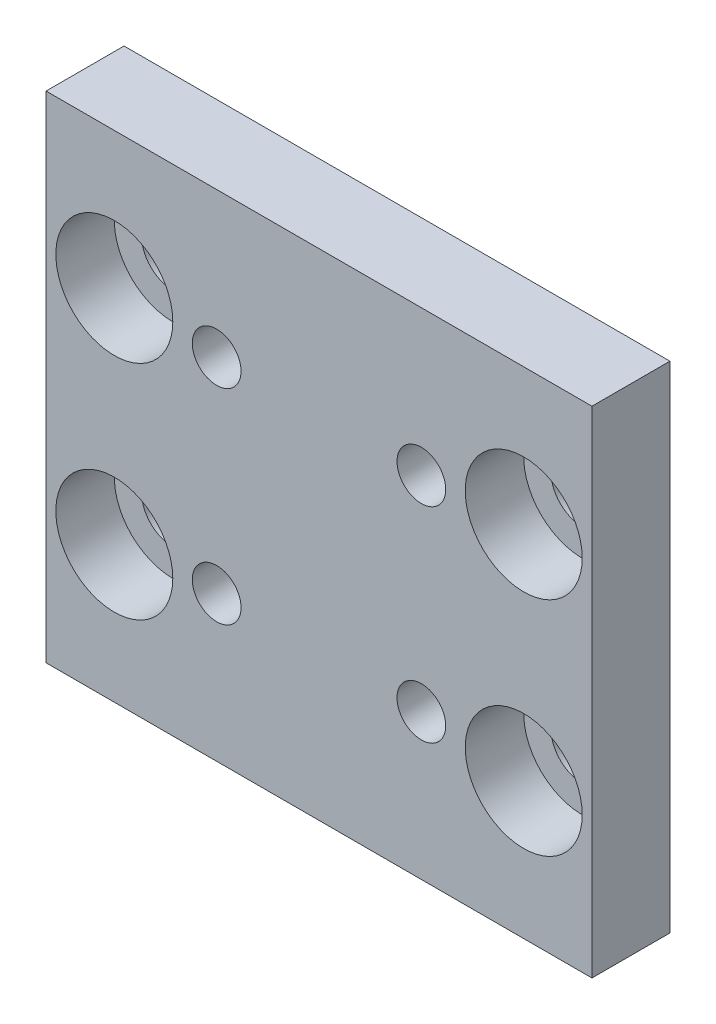
ISO-10303-21;
HEADER;
FILE_DESCRIPTION(('STEP AP214'),'2;1');
FILE_NAME('part.step','',(''),(''),'','','');
FILE_SCHEMA(('AUTOMOTIVE_DESIGN { 1 0 10303 214 1 1 1 1 }'));
ENDSEC;
DATA;
#1=APPLICATION_CONTEXT('core data for automotive mechanical design processes');
#2=APPLICATION_PROTOCOL_DEFINITION('international standard','automotive_design',2000,#1);
#3=PRODUCT_CONTEXT('',#1,'mechanical');
#4=PRODUCT('Part','Part','',(#3));
#5=PRODUCT_RELATED_PRODUCT_CATEGORY('part','',(#4));
#6=PRODUCT_DEFINITION_FORMATION('','',#4);
#7=PRODUCT_DEFINITION_CONTEXT('part definition',#1,'design');
#8=PRODUCT_DEFINITION('design','',#6,#7);
#9=PRODUCT_DEFINITION_SHAPE('','',#8);
#10=(LENGTH_UNIT() NAMED_UNIT(*) SI_UNIT(.MILLI.,.METRE.));
#11=(NAMED_UNIT(*) PLANE_ANGLE_UNIT() SI_UNIT($,.RADIAN.));
#12=(NAMED_UNIT(*) SI_UNIT($,.STERADIAN.) SOLID_ANGLE_UNIT());
#13=UNCERTAINTY_MEASURE_WITH_UNIT(LENGTH_MEASURE(1.E-05),#10,'distance_accuracy_value','');
#14=(GEOMETRIC_REPRESENTATION_CONTEXT(3) GLOBAL_UNCERTAINTY_ASSIGNED_CONTEXT((#13)) GLOBAL_UNIT_ASSIGNED_CONTEXT((#10,
#11,#12)) REPRESENTATION_CONTEXT('',''));
#15=CARTESIAN_POINT('',(0.,0.,0.));
#16=DIRECTION('',(0.,0.,1.));
#17=DIRECTION('',(1.,0.,0.));
#18=AXIS2_PLACEMENT_3D('',#15,#16,#17);
#19=CARTESIAN_POINT('',(3.5,18.4,4.));
#20=DIRECTION('',(0.,0.,-1.));
#21=DIRECTION('',(-1.,0.,0.));
#22=AXIS2_PLACEMENT_3D('',#19,#20,#21);
#23=CYLINDRICAL_SURFACE('',#22,1.6);
#24=CARTESIAN_POINT('',(3.5,18.4,0.));
#25=DIRECTION('',(0.,0.,1.));
#26=DIRECTION('',(1.,0.,0.));
#27=AXIS2_PLACEMENT_3D('',#24,#25,#26);
#28=CIRCLE('',#27,1.6);
#29=CARTESIAN_POINT('',(5.1,18.4,0.));
#30=VERTEX_POINT('',#29);
#31=EDGE_CURVE('E143',#30,#30,#28,.T.);
#32=ORIENTED_EDGE('',*,*,#31,.F.);
#33=EDGE_LOOP('',(#32));
#34=FACE_BOUND('',#33,.T.);
#35=CARTESIAN_POINT('',(3.5,18.4,1.));
#36=DIRECTION('',(0.,0.,1.));
#37=DIRECTION('',(1.,0.,0.));
#38=AXIS2_PLACEMENT_3D('',#35,#36,#37);
#39=CIRCLE('',#38,1.6);
#40=CARTESIAN_POINT('',(5.1,18.4,1.));
#41=VERTEX_POINT('',#40);
#42=EDGE_CURVE('E42',#41,#41,#39,.T.);
#43=ORIENTED_EDGE('',*,*,#42,.T.);
#44=EDGE_LOOP('',(#43));
#45=FACE_BOUND('',#44,.T.);
#46=ADVANCED_FACE('F38',(#34,#45),#23,.F.);
#47=CARTESIAN_POINT('',(3.5,7.,4.));
#48=DIRECTION('',(0.,0.,-1.));
#49=DIRECTION('',(-1.,0.,0.));
#50=AXIS2_PLACEMENT_3D('',#47,#48,#49);
#51=CYLINDRICAL_SURFACE('',#50,1.6);
#52=CARTESIAN_POINT('',(3.5,7.,0.));
#53=DIRECTION('',(0.,0.,1.));
#54=DIRECTION('',(1.,0.,0.));
#55=AXIS2_PLACEMENT_3D('',#52,#53,#54);
#56=CIRCLE('',#55,1.6);
#57=CARTESIAN_POINT('',(5.1,7.,0.));
#58=VERTEX_POINT('',#57);
#59=EDGE_CURVE('E135',#58,#58,#56,.T.);
#60=ORIENTED_EDGE('',*,*,#59,.F.);
#61=EDGE_LOOP('',(#60));
#62=FACE_BOUND('',#61,.T.);
#63=CARTESIAN_POINT('',(3.5,7.,1.));
#64=DIRECTION('',(0.,0.,1.));
#65=DIRECTION('',(1.,0.,0.));
#66=AXIS2_PLACEMENT_3D('',#63,#64,#65);
#67=CIRCLE('',#66,1.6);
#68=CARTESIAN_POINT('',(5.1,7.,1.));
#69=VERTEX_POINT('',#68);
#70=EDGE_CURVE('E121',#69,#69,#67,.T.);
#71=ORIENTED_EDGE('',*,*,#70,.T.);
#72=EDGE_LOOP('',(#71));
#73=FACE_BOUND('',#72,.T.);
#74=ADVANCED_FACE('F189',(#62,#73),#51,.F.);
#75=CARTESIAN_POINT('',(24.5,7.,4.));
#76=DIRECTION('',(0.,0.,-1.));
#77=DIRECTION('',(-1.,0.,0.));
#78=AXIS2_PLACEMENT_3D('',#75,#76,#77);
#79=CYLINDRICAL_SURFACE('',#78,1.6);
#80=CARTESIAN_POINT('',(24.5,7.,0.));
#81=DIRECTION('',(0.,0.,1.));
#82=DIRECTION('',(1.,0.,0.));
#83=AXIS2_PLACEMENT_3D('',#80,#81,#82);
#84=CIRCLE('',#83,1.6);
#85=CARTESIAN_POINT('',(26.1,7.,0.));
#86=VERTEX_POINT('',#85);
#87=EDGE_CURVE('E130',#86,#86,#84,.T.);
#88=ORIENTED_EDGE('',*,*,#87,.F.);
#89=EDGE_LOOP('',(#88));
#90=FACE_BOUND('',#89,.T.);
#91=CARTESIAN_POINT('',(24.5,7.,1.));
#92=DIRECTION('',(0.,0.,1.));
#93=DIRECTION('',(1.,0.,0.));
#94=AXIS2_PLACEMENT_3D('',#91,#92,#93);
#95=CIRCLE('',#94,1.6);
#96=CARTESIAN_POINT('',(26.1,7.,1.));
#97=VERTEX_POINT('',#96);
#98=EDGE_CURVE('E118',#97,#97,#95,.T.);
#99=ORIENTED_EDGE('',*,*,#98,.T.);
#100=EDGE_LOOP('',(#99));
#101=FACE_BOUND('',#100,.T.);
#102=ADVANCED_FACE('F195',(#90,#101),#79,.F.);
#103=CARTESIAN_POINT('',(24.5,18.4,4.));
#104=DIRECTION('',(0.,0.,-1.));
#105=DIRECTION('',(-1.,0.,0.));
#106=AXIS2_PLACEMENT_3D('',#103,#104,#105);
#107=CYLINDRICAL_SURFACE('',#106,1.6);
#108=CARTESIAN_POINT('',(24.5,18.4,0.));
#109=DIRECTION('',(0.,0.,1.));
#110=DIRECTION('',(1.,0.,0.));
#111=AXIS2_PLACEMENT_3D('',#108,#109,#110);
#112=CIRCLE('',#111,1.6);
#113=CARTESIAN_POINT('',(26.1,18.4,0.));
#114=VERTEX_POINT('',#113);
#115=EDGE_CURVE('E126',#114,#114,#112,.T.);
#116=ORIENTED_EDGE('',*,*,#115,.F.);
#117=EDGE_LOOP('',(#116));
#118=FACE_BOUND('',#117,.T.);
#119=CARTESIAN_POINT('',(24.5,18.4,1.));
#120=DIRECTION('',(0.,0.,1.));
#121=DIRECTION('',(1.,0.,0.));
#122=AXIS2_PLACEMENT_3D('',#119,#120,#121);
#123=CIRCLE('',#122,1.6);
#124=CARTESIAN_POINT('',(26.1,18.4,1.));
#125=VERTEX_POINT('',#124);
#126=EDGE_CURVE('E115',#125,#125,#123,.T.);
#127=ORIENTED_EDGE('',*,*,#126,.T.);
#128=EDGE_LOOP('',(#127));
#129=FACE_BOUND('',#128,.T.);
#130=ADVANCED_FACE('F222',(#118,#129),#107,.F.);
#131=CARTESIAN_POINT('',(0.,0.,4.));
#132=DIRECTION('',(0.,0.,-1.));
#133=DIRECTION('',(-1.,0.,0.));
#134=AXIS2_PLACEMENT_3D('',#131,#132,#133);
#135=PLANE('',#134);
#136=CARTESIAN_POINT('',(24.5,7.,4.));
#137=DIRECTION('',(0.,0.,1.));
#138=DIRECTION('',(1.,0.,0.));
#139=AXIS2_PLACEMENT_3D('',#136,#137,#138);
#140=CIRCLE('',#139,3.);
#141=CARTESIAN_POINT('',(27.5,7.,4.));
#142=VERTEX_POINT('',#141);
#143=EDGE_CURVE('E409',#142,#142,#140,.T.);
#144=ORIENTED_EDGE('',*,*,#143,.F.);
#145=EDGE_LOOP('',(#144));
#146=FACE_BOUND('',#145,.T.);
#147=CARTESIAN_POINT('',(3.5,7.,4.));
#148=DIRECTION('',(0.,0.,1.));
#149=DIRECTION('',(1.,0.,0.));
#150=AXIS2_PLACEMENT_3D('',#147,#148,#149);
#151=CIRCLE('',#150,3.);
#152=CARTESIAN_POINT('',(6.5,7.,4.));
#153=VERTEX_POINT('',#152);
#154=EDGE_CURVE('E403',#153,#153,#151,.T.);
#155=ORIENTED_EDGE('',*,*,#154,.F.);
#156=EDGE_LOOP('',(#155));
#157=FACE_BOUND('',#156,.T.);
#158=CARTESIAN_POINT('',(3.5,18.4,4.));
#159=DIRECTION('',(0.,0.,1.));
#160=DIRECTION('',(1.,0.,0.));
#161=AXIS2_PLACEMENT_3D('',#158,#159,#160);
#162=CIRCLE('',#161,3.);
#163=CARTESIAN_POINT('',(6.5,18.4,4.));
#164=VERTEX_POINT('',#163);
#165=EDGE_CURVE('E394',#164,#164,#162,.T.);
#166=ORIENTED_EDGE('',*,*,#165,.F.);
#167=EDGE_LOOP('',(#166));
#168=FACE_BOUND('',#167,.T.);
#169=CARTESIAN_POINT('',(24.5,18.4,4.));
#170=DIRECTION('',(0.,0.,1.));
#171=DIRECTION('',(1.,0.,0.));
#172=AXIS2_PLACEMENT_3D('',#169,#170,#171);
#173=CIRCLE('',#172,3.);
#174=CARTESIAN_POINT('',(27.5,18.4,4.));
#175=VERTEX_POINT('',#174);
#176=EDGE_CURVE('E138',#175,#175,#173,.T.);
#177=ORIENTED_EDGE('',*,*,#176,.F.);
#178=EDGE_LOOP('',(#177));
#179=FACE_BOUND('',#178,.T.);
#180=DIRECTION('',(0.,-1.,0.));
#181=VECTOR('',#180,1.);
#182=CARTESIAN_POINT('',(0.,0.,4.));
#183=LINE('',#182,#181);
#184=CARTESIAN_POINT('',(0.,25.4,4.));
#185=VERTEX_POINT('',#184);
#186=CARTESIAN_POINT('',(0.,0.,4.));
#187=VERTEX_POINT('',#186);
#188=EDGE_CURVE('E93',#185,#187,#183,.T.);
#189=ORIENTED_EDGE('',*,*,#188,.T.);
#190=DIRECTION('',(1.,0.,0.));
#191=VECTOR('',#190,1.);
#192=CARTESIAN_POINT('',(0.,0.,4.));
#193=LINE('',#192,#191);
#194=CARTESIAN_POINT('',(28.,0.,4.));
#195=VERTEX_POINT('',#194);
#196=EDGE_CURVE('E87',#187,#195,#193,.T.);
#197=ORIENTED_EDGE('',*,*,#196,.T.);
#198=DIRECTION('',(0.,1.,0.));
#199=VECTOR('',#198,1.);
#200=CARTESIAN_POINT('',(28.,0.,4.));
#201=LINE('',#200,#199);
#202=CARTESIAN_POINT('',(28.,25.4,4.));
#203=VERTEX_POINT('',#202);
#204=EDGE_CURVE('E91',#195,#203,#201,.T.);
#205=ORIENTED_EDGE('',*,*,#204,.T.);
#206=DIRECTION('',(-1.,0.,0.));
#207=VECTOR('',#206,1.);
#208=CARTESIAN_POINT('',(0.,25.4,4.));
#209=LINE('',#208,#207);
#210=EDGE_CURVE('E57',#203,#185,#209,.T.);
#211=ORIENTED_EDGE('',*,*,#210,.T.);
#212=EDGE_LOOP('',(#189,#197,#205,#211));
#213=FACE_BOUND('',#212,.T.);
#214=CARTESIAN_POINT('',(8.75,17.95,4.));
#215=DIRECTION('',(0.,0.,1.));
#216=DIRECTION('',(1.,0.,0.));
#217=AXIS2_PLACEMENT_3D('',#214,#215,#216);
#218=CIRCLE('',#217,1.25);
#219=CARTESIAN_POINT('',(10.,17.95,4.));
#220=VERTEX_POINT('',#219);
#221=EDGE_CURVE('E109',#220,#220,#218,.T.);
#222=ORIENTED_EDGE('',*,*,#221,.F.);
#223=EDGE_LOOP('',(#222));
#224=FACE_BOUND('',#223,.T.);
#225=CARTESIAN_POINT('',(19.25,17.95,4.));
#226=DIRECTION('',(0.,0.,1.));
#227=DIRECTION('',(1.,0.,0.));
#228=AXIS2_PLACEMENT_3D('',#225,#226,#227);
#229=CIRCLE('',#228,1.25);
#230=CARTESIAN_POINT('',(20.5,17.95,4.));
#231=VERTEX_POINT('',#230);
#232=EDGE_CURVE('E159',#231,#231,#229,.T.);
#233=ORIENTED_EDGE('',*,*,#232,.F.);
#234=EDGE_LOOP('',(#233));
#235=FACE_BOUND('',#234,.T.);
#236=CARTESIAN_POINT('',(19.25,7.45,4.));
#237=DIRECTION('',(0.,0.,1.));
#238=DIRECTION('',(1.,0.,0.));
#239=AXIS2_PLACEMENT_3D('',#236,#237,#238);
#240=CIRCLE('',#239,1.25);
#241=CARTESIAN_POINT('',(20.5,7.45,4.));
#242=VERTEX_POINT('',#241);
#243=EDGE_CURVE('E153',#242,#242,#240,.T.);
#244=ORIENTED_EDGE('',*,*,#243,.F.);
#245=EDGE_LOOP('',(#244));
#246=FACE_BOUND('',#245,.T.);
#247=CARTESIAN_POINT('',(8.75,7.45,4.));
#248=DIRECTION('',(0.,0.,1.));
#249=DIRECTION('',(1.,0.,0.));
#250=AXIS2_PLACEMENT_3D('',#247,#248,#249);
#251=CIRCLE('',#250,1.25);
#252=CARTESIAN_POINT('',(10.,7.45,4.));
#253=VERTEX_POINT('',#252);
#254=EDGE_CURVE('E147',#253,#253,#251,.T.);
#255=ORIENTED_EDGE('',*,*,#254,.F.);
#256=EDGE_LOOP('',(#255));
#257=FACE_BOUND('',#256,.T.);
#258=ADVANCED_FACE('F88',(#146,#157,#168,#179,#213,#224,#235,#246,#257),#135,.F.);
#259=CARTESIAN_POINT('',(0.,0.,0.));
#260=DIRECTION('',(0.,0.,-1.));
#261=DIRECTION('',(-1.,0.,0.));
#262=AXIS2_PLACEMENT_3D('',#259,#260,#261);
#263=PLANE('',#262);
#264=ORIENTED_EDGE('',*,*,#87,.T.);
#265=EDGE_LOOP('',(#264));
#266=FACE_BOUND('',#265,.T.);
#267=ORIENTED_EDGE('',*,*,#31,.T.);
#268=EDGE_LOOP('',(#267));
#269=FACE_BOUND('',#268,.T.);
#270=CARTESIAN_POINT('',(19.25,7.45,0.));
#271=DIRECTION('',(0.,0.,1.));
#272=DIRECTION('',(1.,0.,0.));
#273=AXIS2_PLACEMENT_3D('',#270,#271,#272);
#274=CIRCLE('',#273,1.25);
#275=CARTESIAN_POINT('',(20.5,7.45,0.));
#276=VERTEX_POINT('',#275);
#277=EDGE_CURVE('E150',#276,#276,#274,.T.);
#278=ORIENTED_EDGE('',*,*,#277,.T.);
#279=EDGE_LOOP('',(#278));
#280=FACE_BOUND('',#279,.T.);
#281=CARTESIAN_POINT('',(8.75,17.95,0.));
#282=DIRECTION('',(0.,0.,1.));
#283=DIRECTION('',(1.,0.,0.));
#284=AXIS2_PLACEMENT_3D('',#281,#282,#283);
#285=CIRCLE('',#284,1.25);
#286=CARTESIAN_POINT('',(10.,17.95,0.));
#287=VERTEX_POINT('',#286);
#288=EDGE_CURVE('E162',#287,#287,#285,.T.);
#289=ORIENTED_EDGE('',*,*,#288,.T.);
#290=EDGE_LOOP('',(#289));
#291=FACE_BOUND('',#290,.T.);
#292=DIRECTION('',(0.,-1.,0.));
#293=VECTOR('',#292,1.);
#294=CARTESIAN_POINT('',(0.,0.,0.));
#295=LINE('',#294,#293);
#296=CARTESIAN_POINT('',(0.,25.4,0.));
#297=VERTEX_POINT('',#296);
#298=CARTESIAN_POINT('',(0.,0.,0.));
#299=VERTEX_POINT('',#298);
#300=EDGE_CURVE('E106',#297,#299,#295,.T.);
#301=ORIENTED_EDGE('',*,*,#300,.F.);
#302=DIRECTION('',(-1.,0.,0.));
#303=VECTOR('',#302,1.);
#304=CARTESIAN_POINT('',(0.,25.4,0.));
#305=LINE('',#304,#303);
#306=CARTESIAN_POINT('',(28.,25.4,0.));
#307=VERTEX_POINT('',#306);
#308=EDGE_CURVE('E80',#307,#297,#305,.T.);
#309=ORIENTED_EDGE('',*,*,#308,.F.);
#310=DIRECTION('',(0.,1.,0.));
#311=VECTOR('',#310,1.);
#312=CARTESIAN_POINT('',(28.,0.,0.));
#313=LINE('',#312,#311);
#314=CARTESIAN_POINT('',(28.,0.,0.));
#315=VERTEX_POINT('',#314);
#316=EDGE_CURVE('E74',#315,#307,#313,.T.);
#317=ORIENTED_EDGE('',*,*,#316,.F.);
#318=DIRECTION('',(1.,0.,0.));
#319=VECTOR('',#318,1.);
#320=CARTESIAN_POINT('',(0.,0.,0.));
#321=LINE('',#320,#319);
#322=EDGE_CURVE('E97',#299,#315,#321,.T.);
#323=ORIENTED_EDGE('',*,*,#322,.F.);
#324=EDGE_LOOP('',(#301,#309,#317,#323));
#325=FACE_BOUND('',#324,.T.);
#326=CARTESIAN_POINT('',(19.25,17.95,0.));
#327=DIRECTION('',(0.,0.,1.));
#328=DIRECTION('',(1.,0.,0.));
#329=AXIS2_PLACEMENT_3D('',#326,#327,#328);
#330=CIRCLE('',#329,1.25);
#331=CARTESIAN_POINT('',(20.5,17.95,0.));
#332=VERTEX_POINT('',#331);
#333=EDGE_CURVE('E156',#332,#332,#330,.T.);
#334=ORIENTED_EDGE('',*,*,#333,.T.);
#335=EDGE_LOOP('',(#334));
#336=FACE_BOUND('',#335,.T.);
#337=CARTESIAN_POINT('',(8.75,7.45,0.));
#338=DIRECTION('',(0.,0.,1.));
#339=DIRECTION('',(1.,0.,0.));
#340=AXIS2_PLACEMENT_3D('',#337,#338,#339);
#341=CIRCLE('',#340,1.25);
#342=CARTESIAN_POINT('',(10.,7.45,0.));
#343=VERTEX_POINT('',#342);
#344=EDGE_CURVE('E146',#343,#343,#341,.T.);
#345=ORIENTED_EDGE('',*,*,#344,.T.);
#346=EDGE_LOOP('',(#345));
#347=FACE_BOUND('',#346,.T.);
#348=ORIENTED_EDGE('',*,*,#59,.T.);
#349=EDGE_LOOP('',(#348));
#350=FACE_BOUND('',#349,.T.);
#351=ORIENTED_EDGE('',*,*,#115,.T.);
#352=EDGE_LOOP('',(#351));
#353=FACE_BOUND('',#352,.T.);
#354=ADVANCED_FACE('F170',(#266,#269,#280,#291,#325,#336,#347,#350,#353),#263,.T.);
#355=CARTESIAN_POINT('',(0.,0.,4.));
#356=DIRECTION('',(1.,0.,0.));
#357=DIRECTION('',(0.,0.,-1.));
#358=AXIS2_PLACEMENT_3D('',#355,#356,#357);
#359=PLANE('',#358);
#360=ORIENTED_EDGE('',*,*,#300,.T.);
#361=DIRECTION('',(0.,0.,-1.));
#362=VECTOR('',#361,1.);
#363=CARTESIAN_POINT('',(0.,0.,4.));
#364=LINE('',#363,#362);
#365=EDGE_CURVE('E11',#187,#299,#364,.T.);
#366=ORIENTED_EDGE('',*,*,#365,.F.);
#367=ORIENTED_EDGE('',*,*,#188,.F.);
#368=DIRECTION('',(0.,0.,-1.));
#369=VECTOR('',#368,1.);
#370=CARTESIAN_POINT('',(0.,25.4,4.));
#371=LINE('',#370,#369);
#372=EDGE_CURVE('E102',#185,#297,#371,.T.);
#373=ORIENTED_EDGE('',*,*,#372,.T.);
#374=EDGE_LOOP('',(#360,#366,#367,#373));
#375=FACE_BOUND('',#374,.T.);
#376=ADVANCED_FACE('F40',(#375),#359,.F.);
#377=CARTESIAN_POINT('',(0.,0.,4.));
#378=DIRECTION('',(0.,1.,0.));
#379=DIRECTION('',(0.,0.,1.));
#380=AXIS2_PLACEMENT_3D('',#377,#378,#379);
#381=PLANE('',#380);
#382=ORIENTED_EDGE('',*,*,#322,.T.);
#383=DIRECTION('',(0.,0.,-1.));
#384=VECTOR('',#383,1.);
#385=CARTESIAN_POINT('',(28.,0.,4.));
#386=LINE('',#385,#384);
#387=EDGE_CURVE('E48',#195,#315,#386,.T.);
#388=ORIENTED_EDGE('',*,*,#387,.F.);
#389=ORIENTED_EDGE('',*,*,#196,.F.);
#390=ORIENTED_EDGE('',*,*,#365,.T.);
#391=EDGE_LOOP('',(#382,#388,#389,#390));
#392=FACE_BOUND('',#391,.T.);
#393=ADVANCED_FACE('F96',(#392),#381,.F.);
#394=CARTESIAN_POINT('',(28.,0.,4.));
#395=DIRECTION('',(-1.,0.,0.));
#396=DIRECTION('',(0.,0.,1.));
#397=AXIS2_PLACEMENT_3D('',#394,#395,#396);
#398=PLANE('',#397);
#399=ORIENTED_EDGE('',*,*,#316,.T.);
#400=DIRECTION('',(0.,0.,-1.));
#401=VECTOR('',#400,1.);
#402=CARTESIAN_POINT('',(28.,25.4,4.));
#403=LINE('',#402,#401);
#404=EDGE_CURVE('E98',#203,#307,#403,.T.);
#405=ORIENTED_EDGE('',*,*,#404,.F.);
#406=ORIENTED_EDGE('',*,*,#204,.F.);
#407=ORIENTED_EDGE('',*,*,#387,.T.);
#408=EDGE_LOOP('',(#399,#405,#406,#407));
#409=FACE_BOUND('',#408,.T.);
#410=ADVANCED_FACE('F100',(#409),#398,.F.);
#411=CARTESIAN_POINT('',(0.,25.4,4.));
#412=DIRECTION('',(0.,-1.,0.));
#413=DIRECTION('',(0.,0.,-1.));
#414=AXIS2_PLACEMENT_3D('',#411,#412,#413);
#415=PLANE('',#414);
#416=ORIENTED_EDGE('',*,*,#308,.T.);
#417=ORIENTED_EDGE('',*,*,#372,.F.);
#418=ORIENTED_EDGE('',*,*,#210,.F.);
#419=ORIENTED_EDGE('',*,*,#404,.T.);
#420=EDGE_LOOP('',(#416,#417,#418,#419));
#421=FACE_BOUND('',#420,.T.);
#422=ADVANCED_FACE('F176',(#421),#415,.F.);
#423=CARTESIAN_POINT('',(8.75,17.95,4.));
#424=DIRECTION('',(0.,0.,-1.));
#425=DIRECTION('',(-1.,0.,0.));
#426=AXIS2_PLACEMENT_3D('',#423,#424,#425);
#427=CYLINDRICAL_SURFACE('',#426,1.25);
#428=ORIENTED_EDGE('',*,*,#221,.T.);
#429=EDGE_LOOP('',(#428));
#430=FACE_BOUND('',#429,.T.);
#431=ORIENTED_EDGE('',*,*,#288,.F.);
#432=EDGE_LOOP('',(#431));
#433=FACE_BOUND('',#432,.T.);
#434=ADVANCED_FACE('F173',(#430,#433),#427,.F.);
#435=CARTESIAN_POINT('',(19.25,17.95,4.));
#436=DIRECTION('',(0.,0.,-1.));
#437=DIRECTION('',(-1.,0.,0.));
#438=AXIS2_PLACEMENT_3D('',#435,#436,#437);
#439=CYLINDRICAL_SURFACE('',#438,1.25);
#440=ORIENTED_EDGE('',*,*,#232,.T.);
#441=EDGE_LOOP('',(#440));
#442=FACE_BOUND('',#441,.T.);
#443=ORIENTED_EDGE('',*,*,#333,.F.);
#444=EDGE_LOOP('',(#443));
#445=FACE_BOUND('',#444,.T.);
#446=ADVANCED_FACE('F175',(#442,#445),#439,.F.);
#447=CARTESIAN_POINT('',(19.25,7.45,4.));
#448=DIRECTION('',(0.,0.,-1.));
#449=DIRECTION('',(-1.,0.,0.));
#450=AXIS2_PLACEMENT_3D('',#447,#448,#449);
#451=CYLINDRICAL_SURFACE('',#450,1.25);
#452=ORIENTED_EDGE('',*,*,#243,.T.);
#453=EDGE_LOOP('',(#452));
#454=FACE_BOUND('',#453,.T.);
#455=ORIENTED_EDGE('',*,*,#277,.F.);
#456=EDGE_LOOP('',(#455));
#457=FACE_BOUND('',#456,.T.);
#458=ADVANCED_FACE('F183',(#454,#457),#451,.F.);
#459=CARTESIAN_POINT('',(8.75,7.45,4.));
#460=DIRECTION('',(0.,0.,-1.));
#461=DIRECTION('',(-1.,0.,0.));
#462=AXIS2_PLACEMENT_3D('',#459,#460,#461);
#463=CYLINDRICAL_SURFACE('',#462,1.25);
#464=ORIENTED_EDGE('',*,*,#254,.T.);
#465=EDGE_LOOP('',(#464));
#466=FACE_BOUND('',#465,.T.);
#467=ORIENTED_EDGE('',*,*,#344,.F.);
#468=EDGE_LOOP('',(#467));
#469=FACE_BOUND('',#468,.T.);
#470=ADVANCED_FACE('F201',(#466,#469),#463,.F.);
#471=CARTESIAN_POINT('',(24.5,18.4,1.));
#472=DIRECTION('',(0.,0.,1.));
#473=DIRECTION('',(1.,0.,0.));
#474=AXIS2_PLACEMENT_3D('',#471,#472,#473);
#475=CYLINDRICAL_SURFACE('',#474,3.);
#476=CARTESIAN_POINT('',(24.5,18.4,1.));
#477=DIRECTION('',(0.,0.,1.));
#478=DIRECTION('',(1.,0.,0.));
#479=AXIS2_PLACEMENT_3D('',#476,#477,#478);
#480=CIRCLE('',#479,3.);
#481=CARTESIAN_POINT('',(27.5,18.4,1.));
#482=VERTEX_POINT('',#481);
#483=EDGE_CURVE('E119',#482,#482,#480,.T.);
#484=ORIENTED_EDGE('',*,*,#483,.F.);
#485=EDGE_LOOP('',(#484));
#486=FACE_BOUND('',#485,.T.);
#487=ORIENTED_EDGE('',*,*,#176,.T.);
#488=EDGE_LOOP('',(#487));
#489=FACE_BOUND('',#488,.T.);
#490=ADVANCED_FACE('F204',(#486,#489),#475,.F.);
#491=CARTESIAN_POINT('',(24.5,18.4,1.));
#492=DIRECTION('',(0.,0.,1.));
#493=DIRECTION('',(1.,0.,0.));
#494=AXIS2_PLACEMENT_3D('',#491,#492,#493);
#495=PLANE('',#494);
#496=ORIENTED_EDGE('',*,*,#126,.F.);
#497=EDGE_LOOP('',(#496));
#498=FACE_BOUND('',#497,.T.);
#499=ORIENTED_EDGE('',*,*,#483,.T.);
#500=EDGE_LOOP('',(#499));
#501=FACE_BOUND('',#500,.T.);
#502=ADVANCED_FACE('F316',(#498,#501),#495,.T.);
#503=CARTESIAN_POINT('',(24.5,7.,1.));
#504=DIRECTION('',(0.,0.,1.));
#505=DIRECTION('',(1.,0.,0.));
#506=AXIS2_PLACEMENT_3D('',#503,#504,#505);
#507=CYLINDRICAL_SURFACE('',#506,3.);
#508=CARTESIAN_POINT('',(24.5,7.,1.));
#509=DIRECTION('',(0.,0.,1.));
#510=DIRECTION('',(1.,0.,0.));
#511=AXIS2_PLACEMENT_3D('',#508,#509,#510);
#512=CIRCLE('',#511,3.);
#513=CARTESIAN_POINT('',(27.5,7.,1.));
#514=VERTEX_POINT('',#513);
#515=EDGE_CURVE('E406',#514,#514,#512,.T.);
#516=ORIENTED_EDGE('',*,*,#515,.F.);
#517=EDGE_LOOP('',(#516));
#518=FACE_BOUND('',#517,.T.);
#519=ORIENTED_EDGE('',*,*,#143,.T.);
#520=EDGE_LOOP('',(#519));
#521=FACE_BOUND('',#520,.T.);
#522=ADVANCED_FACE('F326',(#518,#521),#507,.F.);
#523=CARTESIAN_POINT('',(24.5,7.,1.));
#524=DIRECTION('',(0.,0.,1.));
#525=DIRECTION('',(1.,0.,0.));
#526=AXIS2_PLACEMENT_3D('',#523,#524,#525);
#527=PLANE('',#526);
#528=ORIENTED_EDGE('',*,*,#98,.F.);
#529=EDGE_LOOP('',(#528));
#530=FACE_BOUND('',#529,.T.);
#531=ORIENTED_EDGE('',*,*,#515,.T.);
#532=EDGE_LOOP('',(#531));
#533=FACE_BOUND('',#532,.T.);
#534=ADVANCED_FACE('F336',(#530,#533),#527,.T.);
#535=CARTESIAN_POINT('',(3.5,7.,1.));
#536=DIRECTION('',(0.,0.,1.));
#537=DIRECTION('',(1.,0.,0.));
#538=AXIS2_PLACEMENT_3D('',#535,#536,#537);
#539=CYLINDRICAL_SURFACE('',#538,3.);
#540=CARTESIAN_POINT('',(3.5,7.,1.));
#541=DIRECTION('',(0.,0.,1.));
#542=DIRECTION('',(1.,0.,0.));
#543=AXIS2_PLACEMENT_3D('',#540,#541,#542);
#544=CIRCLE('',#543,3.);
#545=CARTESIAN_POINT('',(6.5,7.,1.));
#546=VERTEX_POINT('',#545);
#547=EDGE_CURVE('E398',#546,#546,#544,.T.);
#548=ORIENTED_EDGE('',*,*,#547,.F.);
#549=EDGE_LOOP('',(#548));
#550=FACE_BOUND('',#549,.T.);
#551=ORIENTED_EDGE('',*,*,#154,.T.);
#552=EDGE_LOOP('',(#551));
#553=FACE_BOUND('',#552,.T.);
#554=ADVANCED_FACE('F346',(#550,#553),#539,.F.);
#555=CARTESIAN_POINT('',(3.5,7.,1.));
#556=DIRECTION('',(0.,0.,1.));
#557=DIRECTION('',(1.,0.,0.));
#558=AXIS2_PLACEMENT_3D('',#555,#556,#557);
#559=PLANE('',#558);
#560=ORIENTED_EDGE('',*,*,#70,.F.);
#561=EDGE_LOOP('',(#560));
#562=FACE_BOUND('',#561,.T.);
#563=ORIENTED_EDGE('',*,*,#547,.T.);
#564=EDGE_LOOP('',(#563));
#565=FACE_BOUND('',#564,.T.);
#566=ADVANCED_FACE('F356',(#562,#565),#559,.T.);
#567=CARTESIAN_POINT('',(3.5,18.4,1.));
#568=DIRECTION('',(0.,0.,1.));
#569=DIRECTION('',(1.,0.,0.));
#570=AXIS2_PLACEMENT_3D('',#567,#568,#569);
#571=CYLINDRICAL_SURFACE('',#570,3.);
#572=CARTESIAN_POINT('',(3.5,18.4,1.));
#573=DIRECTION('',(0.,0.,1.));
#574=DIRECTION('',(1.,0.,0.));
#575=AXIS2_PLACEMENT_3D('',#572,#573,#574);
#576=CIRCLE('',#575,3.);
#577=CARTESIAN_POINT('',(6.5,18.4,1.));
#578=VERTEX_POINT('',#577);
#579=EDGE_CURVE('E393',#578,#578,#576,.T.);
#580=ORIENTED_EDGE('',*,*,#579,.F.);
#581=EDGE_LOOP('',(#580));
#582=FACE_BOUND('',#581,.T.);
#583=ORIENTED_EDGE('',*,*,#165,.T.);
#584=EDGE_LOOP('',(#583));
#585=FACE_BOUND('',#584,.T.);
#586=ADVANCED_FACE('F366',(#582,#585),#571,.F.);
#587=CARTESIAN_POINT('',(3.5,18.4,1.));
#588=DIRECTION('',(0.,0.,1.));
#589=DIRECTION('',(1.,0.,0.));
#590=AXIS2_PLACEMENT_3D('',#587,#588,#589);
#591=PLANE('',#590);
#592=ORIENTED_EDGE('',*,*,#42,.F.);
#593=EDGE_LOOP('',(#592));
#594=FACE_BOUND('',#593,.T.);
#595=ORIENTED_EDGE('',*,*,#579,.T.);
#596=EDGE_LOOP('',(#595));
#597=FACE_BOUND('',#596,.T.);
#598=ADVANCED_FACE('F376',(#594,#597),#591,.T.);
#599=CLOSED_SHELL('',(#46,#74,#102,#130,#258,#354,#376,#393,#410,#422,#434,#446,#458,#470,#490,
#502,#522,#534,#554,#566,#586,#598));
#600=MANIFOLD_SOLID_BREP('B2',#599);
#601=ADVANCED_BREP_SHAPE_REPRESENTATION('',(#18,#600),#14);
#602=SHAPE_DEFINITION_REPRESENTATION(#9,#601);
ENDSEC;
END-ISO-10303-21;
